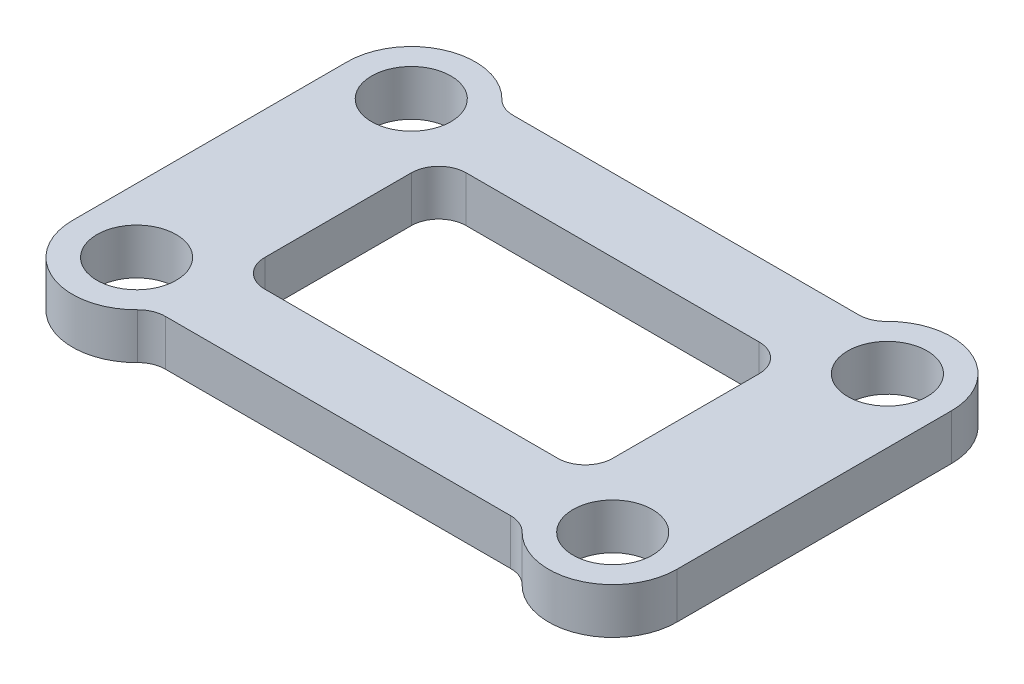
ISO-10303-21;
HEADER;
FILE_DESCRIPTION(('STEP AP214'),'2;1');
FILE_NAME('part.step','',(''),(''),'','','');
FILE_SCHEMA(('AUTOMOTIVE_DESIGN { 1 0 10303 214 1 1 1 1 }'));
ENDSEC;
DATA;
#1=APPLICATION_CONTEXT('core data for automotive mechanical design processes');
#2=APPLICATION_PROTOCOL_DEFINITION('international standard','automotive_design',2000,#1);
#3=PRODUCT_CONTEXT('',#1,'mechanical');
#4=PRODUCT('Part','Part','',(#3));
#5=PRODUCT_RELATED_PRODUCT_CATEGORY('part','',(#4));
#6=PRODUCT_DEFINITION_FORMATION('','',#4);
#7=PRODUCT_DEFINITION_CONTEXT('part definition',#1,'design');
#8=PRODUCT_DEFINITION('design','',#6,#7);
#9=PRODUCT_DEFINITION_SHAPE('','',#8);
#10=(LENGTH_UNIT() NAMED_UNIT(*) SI_UNIT(.MILLI.,.METRE.));
#11=(NAMED_UNIT(*) PLANE_ANGLE_UNIT() SI_UNIT($,.RADIAN.));
#12=(NAMED_UNIT(*) SI_UNIT($,.STERADIAN.) SOLID_ANGLE_UNIT());
#13=UNCERTAINTY_MEASURE_WITH_UNIT(LENGTH_MEASURE(1.E-05),#10,'distance_accuracy_value','');
#14=(GEOMETRIC_REPRESENTATION_CONTEXT(3) GLOBAL_UNCERTAINTY_ASSIGNED_CONTEXT((#13)) GLOBAL_UNIT_ASSIGNED_CONTEXT((#10,
#11,#12)) REPRESENTATION_CONTEXT('',''));
#15=CARTESIAN_POINT('',(0.,0.,0.));
#16=DIRECTION('',(0.,0.,1.));
#17=DIRECTION('',(1.,0.,0.));
#18=AXIS2_PLACEMENT_3D('',#15,#16,#17);
#19=CARTESIAN_POINT('',(-24.765,-22.225,9.525));
#20=DIRECTION('',(-1.,0.,0.));
#21=DIRECTION('',(0.,0.,1.));
#22=AXIS2_PLACEMENT_3D('',#19,#20,#21);
#23=PLANE('',#22);
#24=DIRECTION('',(0.,0.,1.));
#25=VECTOR('',#24,1.);
#26=CARTESIAN_POINT('',(-24.765,-22.225,9.525));
#27=LINE('',#26,#25);
#28=CARTESIAN_POINT('',(-24.765,-22.225,-5.08));
#29=VERTEX_POINT('',#28);
#30=CARTESIAN_POINT('',(-24.765,-22.225,5.08));
#31=VERTEX_POINT('',#30);
#32=EDGE_CURVE('E238',#29,#31,#27,.T.);
#33=ORIENTED_EDGE('',*,*,#32,.F.);
#34=DIRECTION('',(0.,-1.,0.));
#35=VECTOR('',#34,1.);
#36=CARTESIAN_POINT('',(-24.765,-19.05,-5.08));
#37=LINE('',#36,#35);
#38=CARTESIAN_POINT('',(-24.765,-19.05,-5.08));
#39=VERTEX_POINT('',#38);
#40=EDGE_CURVE('E273',#29,#39,#37,.F.);
#41=ORIENTED_EDGE('',*,*,#40,.T.);
#42=DIRECTION('',(0.,0.,1.));
#43=VECTOR('',#42,1.);
#44=CARTESIAN_POINT('',(-24.765,-19.05,9.525));
#45=LINE('',#44,#43);
#46=CARTESIAN_POINT('',(-24.765,-19.05,5.08));
#47=VERTEX_POINT('',#46);
#48=EDGE_CURVE('E233',#39,#47,#45,.T.);
#49=ORIENTED_EDGE('',*,*,#48,.T.);
#50=DIRECTION('',(0.,-1.,0.));
#51=VECTOR('',#50,1.);
#52=CARTESIAN_POINT('',(-24.765,-22.225,5.08));
#53=LINE('',#52,#51);
#54=EDGE_CURVE('E270',#47,#31,#53,.T.);
#55=ORIENTED_EDGE('',*,*,#54,.T.);
#56=EDGE_LOOP('',(#33,#41,#49,#55));
#57=FACE_BOUND('',#56,.T.);
#58=ADVANCED_FACE('F41',(#57),#23,.F.);
#59=CARTESIAN_POINT('',(-0.635,-22.225,9.525));
#60=DIRECTION('',(1.,0.,0.));
#61=DIRECTION('',(0.,0.,-1.));
#62=AXIS2_PLACEMENT_3D('',#59,#60,#61);
#63=PLANE('',#62);
#64=DIRECTION('',(0.,0.,-1.));
#65=VECTOR('',#64,1.);
#66=CARTESIAN_POINT('',(-0.635,-22.225,9.525));
#67=LINE('',#66,#65);
#68=CARTESIAN_POINT('',(-0.635,-22.225,5.08));
#69=VERTEX_POINT('',#68);
#70=CARTESIAN_POINT('',(-0.635,-22.225,-5.08));
#71=VERTEX_POINT('',#70);
#72=EDGE_CURVE('E217',#69,#71,#67,.T.);
#73=ORIENTED_EDGE('',*,*,#72,.F.);
#74=DIRECTION('',(0.,-1.,0.));
#75=VECTOR('',#74,1.);
#76=CARTESIAN_POINT('',(-0.635,-22.225,5.08));
#77=LINE('',#76,#75);
#78=CARTESIAN_POINT('',(-0.635,-19.05,5.08));
#79=VERTEX_POINT('',#78);
#80=EDGE_CURVE('E262',#69,#79,#77,.F.);
#81=ORIENTED_EDGE('',*,*,#80,.T.);
#82=DIRECTION('',(0.,0.,-1.));
#83=VECTOR('',#82,1.);
#84=CARTESIAN_POINT('',(-0.635,-19.05,9.525));
#85=LINE('',#84,#83);
#86=CARTESIAN_POINT('',(-0.635,-19.05,-5.08));
#87=VERTEX_POINT('',#86);
#88=EDGE_CURVE('E205',#79,#87,#85,.T.);
#89=ORIENTED_EDGE('',*,*,#88,.T.);
#90=DIRECTION('',(0.,1.,0.));
#91=VECTOR('',#90,1.);
#92=CARTESIAN_POINT('',(-0.635,-22.225,-5.08));
#93=LINE('',#92,#91);
#94=EDGE_CURVE('E260',#87,#71,#93,.F.);
#95=ORIENTED_EDGE('',*,*,#94,.T.);
#96=EDGE_LOOP('',(#73,#81,#89,#95));
#97=FACE_BOUND('',#96,.T.);
#98=ADVANCED_FACE('F338',(#97),#63,.F.);
#99=CARTESIAN_POINT('',(-29.21,14.3584839524334,12.065));
#100=DIRECTION('',(0.,0.,-1.));
#101=DIRECTION('',(-1.,0.,0.));
#102=AXIS2_PLACEMENT_3D('',#99,#100,#101);
#103=PLANE('',#102);
#104=DIRECTION('',(1.,0.,0.));
#105=VECTOR('',#104,1.);
#106=CARTESIAN_POINT('',(-29.21,-22.225,12.065));
#107=LINE('',#106,#105);
#108=CARTESIAN_POINT('',(-24.6751929478753,-22.225,12.065));
#109=VERTEX_POINT('',#108);
#110=CARTESIAN_POINT('',(-0.724807052124712,-22.225,12.065));
#111=VERTEX_POINT('',#110);
#112=EDGE_CURVE('E208',#109,#111,#107,.T.);
#113=ORIENTED_EDGE('',*,*,#112,.T.);
#114=DIRECTION('',(0.,-1.,0.));
#115=VECTOR('',#114,1.);
#116=CARTESIAN_POINT('',(-0.72480705212471,-19.05,12.065));
#117=LINE('',#116,#115);
#118=CARTESIAN_POINT('',(-0.724807052124712,-19.05,12.065));
#119=VERTEX_POINT('',#118);
#120=EDGE_CURVE('E290',#111,#119,#117,.F.);
#121=ORIENTED_EDGE('',*,*,#120,.T.);
#122=DIRECTION('',(-1.,0.,0.));
#123=VECTOR('',#122,1.);
#124=CARTESIAN_POINT('',(-29.21,-19.05,12.065));
#125=LINE('',#124,#123);
#126=CARTESIAN_POINT('',(-24.6751929478753,-19.05,12.065));
#127=VERTEX_POINT('',#126);
#128=EDGE_CURVE('E221',#119,#127,#125,.T.);
#129=ORIENTED_EDGE('',*,*,#128,.T.);
#130=DIRECTION('',(0.,-1.,0.));
#131=VECTOR('',#130,1.);
#132=CARTESIAN_POINT('',(-24.6751929478753,-22.225,12.065));
#133=LINE('',#132,#131);
#134=EDGE_CURVE('E287',#127,#109,#133,.T.);
#135=ORIENTED_EDGE('',*,*,#134,.T.);
#136=EDGE_LOOP('',(#113,#121,#129,#135));
#137=FACE_BOUND('',#136,.T.);
#138=ADVANCED_FACE('F324',(#137),#103,.F.);
#139=CARTESIAN_POINT('',(-29.21,14.3584839524334,6.985));
#140=DIRECTION('',(0.,0.,-1.));
#141=DIRECTION('',(-1.,0.,0.));
#142=AXIS2_PLACEMENT_3D('',#139,#140,#141);
#143=PLANE('',#142);
#144=DIRECTION('',(-1.,0.,0.));
#145=VECTOR('',#144,1.);
#146=CARTESIAN_POINT('',(-29.21,-19.05,6.985));
#147=LINE('',#146,#145);
#148=CARTESIAN_POINT('',(-2.54,-19.05,6.985));
#149=VERTEX_POINT('',#148);
#150=CARTESIAN_POINT('',(-22.86,-19.05,6.985));
#151=VERTEX_POINT('',#150);
#152=EDGE_CURVE('E224',#149,#151,#147,.T.);
#153=ORIENTED_EDGE('',*,*,#152,.F.);
#154=DIRECTION('',(0.,-1.,0.));
#155=VECTOR('',#154,1.);
#156=CARTESIAN_POINT('',(-2.54,14.3584839524334,6.985));
#157=LINE('',#156,#155);
#158=CARTESIAN_POINT('',(-2.54,-22.225,6.985));
#159=VERTEX_POINT('',#158);
#160=EDGE_CURVE('E257',#149,#159,#157,.T.);
#161=ORIENTED_EDGE('',*,*,#160,.T.);
#162=DIRECTION('',(1.,0.,0.));
#163=VECTOR('',#162,1.);
#164=CARTESIAN_POINT('',(-29.21,-22.225,6.985));
#165=LINE('',#164,#163);
#166=CARTESIAN_POINT('',(-22.86,-22.225,6.985));
#167=VERTEX_POINT('',#166);
#168=EDGE_CURVE('E204',#167,#159,#165,.T.);
#169=ORIENTED_EDGE('',*,*,#168,.F.);
#170=DIRECTION('',(0.,-1.,0.));
#171=VECTOR('',#170,1.);
#172=CARTESIAN_POINT('',(-22.86,14.3584839524334,6.985));
#173=LINE('',#172,#171);
#174=EDGE_CURVE('E255',#167,#151,#173,.F.);
#175=ORIENTED_EDGE('',*,*,#174,.T.);
#176=EDGE_LOOP('',(#153,#161,#169,#175));
#177=FACE_BOUND('',#176,.T.);
#178=ADVANCED_FACE('F362',(#177),#143,.T.);
#179=CARTESIAN_POINT('',(-29.21,-22.225,9.525));
#180=DIRECTION('',(0.,1.,0.));
#181=DIRECTION('',(0.,0.,1.));
#182=AXIS2_PLACEMENT_3D('',#179,#180,#181);
#183=CYLINDRICAL_SURFACE('',#182,4.445);
#184=CARTESIAN_POINT('',(-29.21,-22.225,9.525));
#185=DIRECTION('',(0.,-1.,0.));
#186=DIRECTION('',(0.,0.,-1.));
#187=AXIS2_PLACEMENT_3D('',#184,#185,#186);
#188=CIRCLE('',#187,4.445);
#189=CARTESIAN_POINT('',(-26.0356350635127,-22.225,12.6365));
#190=VERTEX_POINT('',#189);
#191=CARTESIAN_POINT('',(-33.655,-22.225,9.525));
#192=VERTEX_POINT('',#191);
#193=EDGE_CURVE('E230',#190,#192,#188,.T.);
#194=ORIENTED_EDGE('',*,*,#193,.F.);
#195=DIRECTION('',(0.,1.,0.));
#196=VECTOR('',#195,1.);
#197=CARTESIAN_POINT('',(-26.0356350635127,-22.225,12.6365));
#198=LINE('',#197,#196);
#199=CARTESIAN_POINT('',(-26.0356350635127,-19.05,12.6365));
#200=VERTEX_POINT('',#199);
#201=EDGE_CURVE('E62',#190,#200,#198,.T.);
#202=ORIENTED_EDGE('',*,*,#201,.T.);
#203=CARTESIAN_POINT('',(-29.21,-19.05,9.525));
#204=DIRECTION('',(0.,-1.,0.));
#205=DIRECTION('',(0.,0.,-1.));
#206=AXIS2_PLACEMENT_3D('',#203,#204,#205);
#207=CIRCLE('',#206,4.445);
#208=CARTESIAN_POINT('',(-33.655,-19.05,9.525));
#209=VERTEX_POINT('',#208);
#210=EDGE_CURVE('E226',#200,#209,#207,.T.);
#211=ORIENTED_EDGE('',*,*,#210,.T.);
#212=DIRECTION('',(0.,1.,0.));
#213=VECTOR('',#212,1.);
#214=CARTESIAN_POINT('',(-33.655,-22.225,9.525));
#215=LINE('',#214,#213);
#216=EDGE_CURVE('E252',#192,#209,#215,.T.);
#217=ORIENTED_EDGE('',*,*,#216,.F.);
#218=EDGE_LOOP('',(#194,#202,#211,#217));
#219=FACE_BOUND('',#218,.T.);
#220=ADVANCED_FACE('F358',(#219),#183,.T.);
#221=CARTESIAN_POINT('',(-33.655,-22.225,9.525));
#222=DIRECTION('',(1.,0.,0.));
#223=DIRECTION('',(0.,0.,-1.));
#224=AXIS2_PLACEMENT_3D('',#221,#222,#223);
#225=PLANE('',#224);
#226=DIRECTION('',(0.,0.,-1.));
#227=VECTOR('',#226,1.);
#228=CARTESIAN_POINT('',(-33.655,-19.05,9.525));
#229=LINE('',#228,#227);
#230=CARTESIAN_POINT('',(-33.655,-19.05,-9.525));
#231=VERTEX_POINT('',#230);
#232=EDGE_CURVE('E243',#209,#231,#229,.T.);
#233=ORIENTED_EDGE('',*,*,#232,.T.);
#234=DIRECTION('',(0.,1.,0.));
#235=VECTOR('',#234,1.);
#236=CARTESIAN_POINT('',(-33.655,-22.225,-9.525));
#237=LINE('',#236,#235);
#238=CARTESIAN_POINT('',(-33.655,-22.225,-9.525));
#239=VERTEX_POINT('',#238);
#240=EDGE_CURVE('E241',#239,#231,#237,.T.);
#241=ORIENTED_EDGE('',*,*,#240,.F.);
#242=DIRECTION('',(0.,0.,-1.));
#243=VECTOR('',#242,1.);
#244=CARTESIAN_POINT('',(-33.655,-22.225,9.525));
#245=LINE('',#244,#243);
#246=EDGE_CURVE('E232',#192,#239,#245,.T.);
#247=ORIENTED_EDGE('',*,*,#246,.F.);
#248=ORIENTED_EDGE('',*,*,#216,.T.);
#249=EDGE_LOOP('',(#233,#241,#247,#248));
#250=FACE_BOUND('',#249,.T.);
#251=ADVANCED_FACE('F354',(#250),#225,.F.);
#252=CARTESIAN_POINT('',(-29.21,-22.225,-9.525));
#253=DIRECTION('',(0.,1.,0.));
#254=DIRECTION('',(0.,0.,1.));
#255=AXIS2_PLACEMENT_3D('',#252,#253,#254);
#256=CYLINDRICAL_SURFACE('',#255,4.445);
#257=CARTESIAN_POINT('',(-29.21,-19.05,-9.525));
#258=DIRECTION('',(0.,-1.,0.));
#259=DIRECTION('',(0.,0.,-1.));
#260=AXIS2_PLACEMENT_3D('',#257,#258,#259);
#261=CIRCLE('',#260,4.445);
#262=CARTESIAN_POINT('',(-26.0356350635127,-19.05,-12.6365));
#263=VERTEX_POINT('',#262);
#264=EDGE_CURVE('E245',#231,#263,#261,.T.);
#265=ORIENTED_EDGE('',*,*,#264,.T.);
#266=DIRECTION('',(0.,1.,0.));
#267=VECTOR('',#266,1.);
#268=CARTESIAN_POINT('',(-26.0356350635127,-22.225,-12.6365));
#269=LINE('',#268,#267);
#270=CARTESIAN_POINT('',(-26.0356350635127,-22.225,-12.6365));
#271=VERTEX_POINT('',#270);
#272=EDGE_CURVE('E275',#263,#271,#269,.F.);
#273=ORIENTED_EDGE('',*,*,#272,.T.);
#274=CARTESIAN_POINT('',(-29.21,-22.225,-9.525));
#275=DIRECTION('',(0.,-1.,0.));
#276=DIRECTION('',(0.,0.,-1.));
#277=AXIS2_PLACEMENT_3D('',#274,#275,#276);
#278=CIRCLE('',#277,4.445);
#279=EDGE_CURVE('E235',#239,#271,#278,.T.);
#280=ORIENTED_EDGE('',*,*,#279,.F.);
#281=ORIENTED_EDGE('',*,*,#240,.T.);
#282=EDGE_LOOP('',(#265,#273,#280,#281));
#283=FACE_BOUND('',#282,.T.);
#284=ADVANCED_FACE('F351',(#283),#256,.T.);
#285=CARTESIAN_POINT('',(-29.21,-22.225,9.525));
#286=DIRECTION('',(0.,-1.,0.));
#287=DIRECTION('',(0.,0.,-1.));
#288=AXIS2_PLACEMENT_3D('',#285,#286,#287);
#289=PLANE('',#288);
#290=CARTESIAN_POINT('',(-29.21,-22.225,9.525));
#291=DIRECTION('',(0.,-1.,0.));
#292=DIRECTION('',(0.,0.,-1.));
#293=AXIS2_PLACEMENT_3D('',#290,#291,#292);
#294=CIRCLE('',#293,2.74999999999999);
#295=CARTESIAN_POINT('',(-29.21,-22.225,6.77500000000001));
#296=VERTEX_POINT('',#295);
#297=EDGE_CURVE('E448',#296,#296,#294,.T.);
#298=ORIENTED_EDGE('',*,*,#297,.F.);
#299=EDGE_LOOP('',(#298));
#300=FACE_BOUND('',#299,.T.);
#301=CARTESIAN_POINT('',(-29.21,-22.225,-9.525));
#302=DIRECTION('',(0.,-1.,0.));
#303=DIRECTION('',(0.,0.,-1.));
#304=AXIS2_PLACEMENT_3D('',#301,#302,#303);
#305=CIRCLE('',#304,2.74999999999999);
#306=CARTESIAN_POINT('',(-29.21,-22.225,-12.275));
#307=VERTEX_POINT('',#306);
#308=EDGE_CURVE('E442',#307,#307,#305,.T.);
#309=ORIENTED_EDGE('',*,*,#308,.F.);
#310=EDGE_LOOP('',(#309));
#311=FACE_BOUND('',#310,.T.);
#312=CARTESIAN_POINT('',(3.81,-22.225,9.525));
#313=DIRECTION('',(0.,-1.,0.));
#314=DIRECTION('',(0.,0.,-1.));
#315=AXIS2_PLACEMENT_3D('',#312,#313,#314);
#316=CIRCLE('',#315,2.74999999999999);
#317=CARTESIAN_POINT('',(3.81,-22.225,6.77500000000001));
#318=VERTEX_POINT('',#317);
#319=EDGE_CURVE('E436',#318,#318,#316,.T.);
#320=ORIENTED_EDGE('',*,*,#319,.F.);
#321=EDGE_LOOP('',(#320));
#322=FACE_BOUND('',#321,.T.);
#323=CARTESIAN_POINT('',(3.81,-22.225,-9.525));
#324=DIRECTION('',(0.,-1.,0.));
#325=DIRECTION('',(0.,0.,-1.));
#326=AXIS2_PLACEMENT_3D('',#323,#324,#325);
#327=CIRCLE('',#326,2.74999999999999);
#328=CARTESIAN_POINT('',(3.81,-22.225,-12.275));
#329=VERTEX_POINT('',#328);
#330=EDGE_CURVE('E430',#329,#329,#327,.T.);
#331=ORIENTED_EDGE('',*,*,#330,.F.);
#332=EDGE_LOOP('',(#331));
#333=FACE_BOUND('',#332,.T.);
#334=ORIENTED_EDGE('',*,*,#279,.T.);
#335=CARTESIAN_POINT('',(-24.6751929478753,-22.225,-13.97));
#336=DIRECTION('',(0.,-1.,0.));
#337=DIRECTION('',(0.,0.,-1.));
#338=AXIS2_PLACEMENT_3D('',#335,#336,#337);
#339=CIRCLE('',#338,1.905);
#340=CARTESIAN_POINT('',(-24.6751929478753,-22.225,-12.065));
#341=VERTEX_POINT('',#340);
#342=EDGE_CURVE('E301',#271,#341,#339,.F.);
#343=ORIENTED_EDGE('',*,*,#342,.T.);
#344=DIRECTION('',(1.,0.,0.));
#345=VECTOR('',#344,1.);
#346=CARTESIAN_POINT('',(-29.21,-22.225,-12.065));
#347=LINE('',#346,#345);
#348=CARTESIAN_POINT('',(-0.724807052124708,-22.225,-12.065));
#349=VERTEX_POINT('',#348);
#350=EDGE_CURVE('E397',#341,#349,#347,.T.);
#351=ORIENTED_EDGE('',*,*,#350,.T.);
#352=CARTESIAN_POINT('',(-0.724807052124709,-22.225,-13.97));
#353=DIRECTION('',(0.,-1.,0.));
#354=DIRECTION('',(0.,0.,-1.));
#355=AXIS2_PLACEMENT_3D('',#352,#353,#354);
#356=CIRCLE('',#355,1.905);
#357=CARTESIAN_POINT('',(0.635635063512704,-22.225,-12.6365));
#358=VERTEX_POINT('',#357);
#359=EDGE_CURVE('E307',#349,#358,#356,.F.);
#360=ORIENTED_EDGE('',*,*,#359,.T.);
#361=CARTESIAN_POINT('',(3.81,-22.225,-9.525));
#362=DIRECTION('',(0.,-1.,0.));
#363=DIRECTION('',(0.,0.,-1.));
#364=AXIS2_PLACEMENT_3D('',#361,#362,#363);
#365=CIRCLE('',#364,4.445);
#366=CARTESIAN_POINT('',(8.255,-22.225,-9.525));
#367=VERTEX_POINT('',#366);
#368=EDGE_CURVE('E215',#358,#367,#365,.T.);
#369=ORIENTED_EDGE('',*,*,#368,.T.);
#370=DIRECTION('',(0.,0.,1.));
#371=VECTOR('',#370,1.);
#372=CARTESIAN_POINT('',(8.255,-22.225,9.525));
#373=LINE('',#372,#371);
#374=CARTESIAN_POINT('',(8.255,-22.225,9.525));
#375=VERTEX_POINT('',#374);
#376=EDGE_CURVE('E198',#367,#375,#373,.T.);
#377=ORIENTED_EDGE('',*,*,#376,.T.);
#378=CARTESIAN_POINT('',(3.81,-22.225,9.525));
#379=DIRECTION('',(0.,-1.,0.));
#380=DIRECTION('',(0.,0.,-1.));
#381=AXIS2_PLACEMENT_3D('',#378,#379,#380);
#382=CIRCLE('',#381,4.445);
#383=CARTESIAN_POINT('',(0.635635063512703,-22.225,12.6365));
#384=VERTEX_POINT('',#383);
#385=EDGE_CURVE('E189',#375,#384,#382,.T.);
#386=ORIENTED_EDGE('',*,*,#385,.T.);
#387=CARTESIAN_POINT('',(-0.72480705212471,-22.225,13.97));
#388=DIRECTION('',(0.,-1.,0.));
#389=DIRECTION('',(0.,0.,-1.));
#390=AXIS2_PLACEMENT_3D('',#387,#388,#389);
#391=CIRCLE('',#390,1.905);
#392=EDGE_CURVE('E317',#384,#111,#391,.F.);
#393=ORIENTED_EDGE('',*,*,#392,.T.);
#394=ORIENTED_EDGE('',*,*,#112,.F.);
#395=CARTESIAN_POINT('',(-24.6751929478753,-22.225,13.97));
#396=DIRECTION('',(0.,-1.,0.));
#397=DIRECTION('',(0.,0.,-1.));
#398=AXIS2_PLACEMENT_3D('',#395,#396,#397);
#399=CIRCLE('',#398,1.905);
#400=EDGE_CURVE('E49',#109,#190,#399,.F.);
#401=ORIENTED_EDGE('',*,*,#400,.T.);
#402=ORIENTED_EDGE('',*,*,#193,.T.);
#403=ORIENTED_EDGE('',*,*,#246,.T.);
#404=EDGE_LOOP('',(#334,#343,#351,#360,#369,#377,#386,#393,#394,#401,#402,#403));
#405=FACE_BOUND('',#404,.T.);
#406=DIRECTION('',(1.,0.,0.));
#407=VECTOR('',#406,1.);
#408=CARTESIAN_POINT('',(-29.21,-22.225,-6.985));
#409=LINE('',#408,#407);
#410=CARTESIAN_POINT('',(-22.86,-22.225,-6.985));
#411=VERTEX_POINT('',#410);
#412=CARTESIAN_POINT('',(-2.54,-22.225,-6.985));
#413=VERTEX_POINT('',#412);
#414=EDGE_CURVE('E389',#411,#413,#409,.T.);
#415=ORIENTED_EDGE('',*,*,#414,.F.);
#416=CARTESIAN_POINT('',(-22.86,-22.225,-5.08));
#417=DIRECTION('',(0.,-1.,0.));
#418=DIRECTION('',(0.,0.,-1.));
#419=AXIS2_PLACEMENT_3D('',#416,#417,#418);
#420=CIRCLE('',#419,1.905);
#421=EDGE_CURVE('E297',#411,#29,#420,.F.);
#422=ORIENTED_EDGE('',*,*,#421,.T.);
#423=ORIENTED_EDGE('',*,*,#32,.T.);
#424=CARTESIAN_POINT('',(-22.86,-22.225,5.08));
#425=DIRECTION('',(0.,-1.,0.));
#426=DIRECTION('',(0.,0.,-1.));
#427=AXIS2_PLACEMENT_3D('',#424,#425,#426);
#428=CIRCLE('',#427,1.905);
#429=EDGE_CURVE('E313',#31,#167,#428,.F.);
#430=ORIENTED_EDGE('',*,*,#429,.T.);
#431=ORIENTED_EDGE('',*,*,#168,.T.);
#432=CARTESIAN_POINT('',(-2.54,-22.225,5.08));
#433=DIRECTION('',(0.,-1.,0.));
#434=DIRECTION('',(0.,0.,-1.));
#435=AXIS2_PLACEMENT_3D('',#432,#433,#434);
#436=CIRCLE('',#435,1.905);
#437=EDGE_CURVE('E293',#159,#69,#436,.F.);
#438=ORIENTED_EDGE('',*,*,#437,.T.);
#439=ORIENTED_EDGE('',*,*,#72,.T.);
#440=CARTESIAN_POINT('',(-2.54,-22.225,-5.08));
#441=DIRECTION('',(0.,-1.,0.));
#442=DIRECTION('',(0.,0.,-1.));
#443=AXIS2_PLACEMENT_3D('',#440,#441,#442);
#444=CIRCLE('',#443,1.905);
#445=EDGE_CURVE('E311',#71,#413,#444,.F.);
#446=ORIENTED_EDGE('',*,*,#445,.T.);
#447=EDGE_LOOP('',(#415,#422,#423,#430,#431,#438,#439,#446));
#448=FACE_BOUND('',#447,.T.);
#449=ADVANCED_FACE('F319',(#300,#311,#322,#333,#405,#448),#289,.T.);
#450=CARTESIAN_POINT('',(-29.21,-19.05,9.525));
#451=DIRECTION('',(0.,-1.,0.));
#452=DIRECTION('',(0.,0.,-1.));
#453=AXIS2_PLACEMENT_3D('',#450,#451,#452);
#454=PLANE('',#453);
#455=CARTESIAN_POINT('',(-29.21,-19.05,9.525));
#456=DIRECTION('',(0.,-1.,0.));
#457=DIRECTION('',(0.,0.,-1.));
#458=AXIS2_PLACEMENT_3D('',#455,#456,#457);
#459=CIRCLE('',#458,2.75);
#460=CARTESIAN_POINT('',(-29.21,-19.05,6.775));
#461=VERTEX_POINT('',#460);
#462=EDGE_CURVE('E445',#461,#461,#459,.T.);
#463=ORIENTED_EDGE('',*,*,#462,.T.);
#464=EDGE_LOOP('',(#463));
#465=FACE_BOUND('',#464,.T.);
#466=CARTESIAN_POINT('',(-29.21,-19.05,-9.525));
#467=DIRECTION('',(0.,-1.,0.));
#468=DIRECTION('',(0.,0.,-1.));
#469=AXIS2_PLACEMENT_3D('',#466,#467,#468);
#470=CIRCLE('',#469,2.75);
#471=CARTESIAN_POINT('',(-29.21,-19.05,-12.275));
#472=VERTEX_POINT('',#471);
#473=EDGE_CURVE('E439',#472,#472,#470,.T.);
#474=ORIENTED_EDGE('',*,*,#473,.T.);
#475=EDGE_LOOP('',(#474));
#476=FACE_BOUND('',#475,.T.);
#477=CARTESIAN_POINT('',(3.81,-19.05,9.525));
#478=DIRECTION('',(0.,-1.,0.));
#479=DIRECTION('',(0.,0.,-1.));
#480=AXIS2_PLACEMENT_3D('',#477,#478,#479);
#481=CIRCLE('',#480,2.75);
#482=CARTESIAN_POINT('',(3.81,-19.05,6.775));
#483=VERTEX_POINT('',#482);
#484=EDGE_CURVE('E433',#483,#483,#481,.T.);
#485=ORIENTED_EDGE('',*,*,#484,.T.);
#486=EDGE_LOOP('',(#485));
#487=FACE_BOUND('',#486,.T.);
#488=CARTESIAN_POINT('',(3.81,-19.05,-9.525));
#489=DIRECTION('',(0.,-1.,0.));
#490=DIRECTION('',(0.,0.,-1.));
#491=AXIS2_PLACEMENT_3D('',#488,#489,#490);
#492=CIRCLE('',#491,2.75);
#493=CARTESIAN_POINT('',(3.81,-19.05,-12.275));
#494=VERTEX_POINT('',#493);
#495=EDGE_CURVE('E402',#494,#494,#492,.T.);
#496=ORIENTED_EDGE('',*,*,#495,.T.);
#497=EDGE_LOOP('',(#496));
#498=FACE_BOUND('',#497,.T.);
#499=ORIENTED_EDGE('',*,*,#48,.F.);
#500=CARTESIAN_POINT('',(-22.86,-19.05,-5.08));
#501=DIRECTION('',(0.,-1.,0.));
#502=DIRECTION('',(0.,0.,-1.));
#503=AXIS2_PLACEMENT_3D('',#500,#501,#502);
#504=CIRCLE('',#503,1.905);
#505=CARTESIAN_POINT('',(-22.86,-19.05,-6.985));
#506=VERTEX_POINT('',#505);
#507=EDGE_CURVE('E299',#39,#506,#504,.T.);
#508=ORIENTED_EDGE('',*,*,#507,.T.);
#509=DIRECTION('',(-1.,0.,0.));
#510=VECTOR('',#509,1.);
#511=CARTESIAN_POINT('',(-29.21,-19.05,-6.985));
#512=LINE('',#511,#510);
#513=CARTESIAN_POINT('',(-2.54,-19.05,-6.985));
#514=VERTEX_POINT('',#513);
#515=EDGE_CURVE('E396',#514,#506,#512,.T.);
#516=ORIENTED_EDGE('',*,*,#515,.F.);
#517=CARTESIAN_POINT('',(-2.54,-19.05,-5.08));
#518=DIRECTION('',(0.,-1.,0.));
#519=DIRECTION('',(0.,0.,-1.));
#520=AXIS2_PLACEMENT_3D('',#517,#518,#519);
#521=CIRCLE('',#520,1.905);
#522=EDGE_CURVE('E309',#514,#87,#521,.T.);
#523=ORIENTED_EDGE('',*,*,#522,.T.);
#524=ORIENTED_EDGE('',*,*,#88,.F.);
#525=CARTESIAN_POINT('',(-2.54,-19.05,5.08));
#526=DIRECTION('',(0.,-1.,0.));
#527=DIRECTION('',(0.,0.,-1.));
#528=AXIS2_PLACEMENT_3D('',#525,#526,#527);
#529=CIRCLE('',#528,1.905);
#530=EDGE_CURVE('E295',#79,#149,#529,.T.);
#531=ORIENTED_EDGE('',*,*,#530,.T.);
#532=ORIENTED_EDGE('',*,*,#152,.T.);
#533=CARTESIAN_POINT('',(-22.86,-19.05,5.08));
#534=DIRECTION('',(0.,-1.,0.));
#535=DIRECTION('',(0.,0.,-1.));
#536=AXIS2_PLACEMENT_3D('',#533,#534,#535);
#537=CIRCLE('',#536,1.905);
#538=EDGE_CURVE('E315',#151,#47,#537,.T.);
#539=ORIENTED_EDGE('',*,*,#538,.T.);
#540=EDGE_LOOP('',(#499,#508,#516,#523,#524,#531,#532,#539));
#541=FACE_BOUND('',#540,.T.);
#542=CARTESIAN_POINT('',(3.81,-19.05,-9.525));
#543=DIRECTION('',(0.,-1.,0.));
#544=DIRECTION('',(0.,0.,-1.));
#545=AXIS2_PLACEMENT_3D('',#542,#543,#544);
#546=CIRCLE('',#545,4.445);
#547=CARTESIAN_POINT('',(0.635635063512704,-19.05,-12.6365));
#548=VERTEX_POINT('',#547);
#549=CARTESIAN_POINT('',(8.255,-19.05,-9.525));
#550=VERTEX_POINT('',#549);
#551=EDGE_CURVE('E188',#548,#550,#546,.T.);
#552=ORIENTED_EDGE('',*,*,#551,.F.);
#553=CARTESIAN_POINT('',(-0.724807052124709,-19.05,-13.97));
#554=DIRECTION('',(0.,-1.,0.));
#555=DIRECTION('',(0.,0.,-1.));
#556=AXIS2_PLACEMENT_3D('',#553,#554,#555);
#557=CIRCLE('',#556,1.905);
#558=CARTESIAN_POINT('',(-0.724807052124708,-19.05,-12.065));
#559=VERTEX_POINT('',#558);
#560=EDGE_CURVE('E305',#548,#559,#557,.T.);
#561=ORIENTED_EDGE('',*,*,#560,.T.);
#562=DIRECTION('',(-1.,0.,0.));
#563=VECTOR('',#562,1.);
#564=CARTESIAN_POINT('',(-29.21,-19.05,-12.065));
#565=LINE('',#564,#563);
#566=CARTESIAN_POINT('',(-24.6751929478753,-19.05,-12.065));
#567=VERTEX_POINT('',#566);
#568=EDGE_CURVE('E399',#559,#567,#565,.T.);
#569=ORIENTED_EDGE('',*,*,#568,.T.);
#570=CARTESIAN_POINT('',(-24.6751929478753,-19.05,-13.97));
#571=DIRECTION('',(0.,-1.,0.));
#572=DIRECTION('',(0.,0.,-1.));
#573=AXIS2_PLACEMENT_3D('',#570,#571,#572);
#574=CIRCLE('',#573,1.905);
#575=EDGE_CURVE('E303',#567,#263,#574,.T.);
#576=ORIENTED_EDGE('',*,*,#575,.T.);
#577=ORIENTED_EDGE('',*,*,#264,.F.);
#578=ORIENTED_EDGE('',*,*,#232,.F.);
#579=ORIENTED_EDGE('',*,*,#210,.F.);
#580=CARTESIAN_POINT('',(-24.6751929478753,-19.05,13.97));
#581=DIRECTION('',(0.,-1.,0.));
#582=DIRECTION('',(0.,0.,-1.));
#583=AXIS2_PLACEMENT_3D('',#580,#581,#582);
#584=CIRCLE('',#583,1.905);
#585=EDGE_CURVE('E11',#200,#127,#584,.T.);
#586=ORIENTED_EDGE('',*,*,#585,.T.);
#587=ORIENTED_EDGE('',*,*,#128,.F.);
#588=CARTESIAN_POINT('',(-0.72480705212471,-19.05,13.97));
#589=DIRECTION('',(0.,-1.,0.));
#590=DIRECTION('',(0.,0.,-1.));
#591=AXIS2_PLACEMENT_3D('',#588,#589,#590);
#592=CIRCLE('',#591,1.905);
#593=CARTESIAN_POINT('',(0.635635063512703,-19.05,12.6365));
#594=VERTEX_POINT('',#593);
#595=EDGE_CURVE('E203',#119,#594,#592,.T.);
#596=ORIENTED_EDGE('',*,*,#595,.T.);
#597=CARTESIAN_POINT('',(3.81,-19.05,9.525));
#598=DIRECTION('',(0.,-1.,0.));
#599=DIRECTION('',(0.,0.,-1.));
#600=AXIS2_PLACEMENT_3D('',#597,#598,#599);
#601=CIRCLE('',#600,4.445);
#602=CARTESIAN_POINT('',(8.255,-19.05,9.525));
#603=VERTEX_POINT('',#602);
#604=EDGE_CURVE('E195',#603,#594,#601,.T.);
#605=ORIENTED_EDGE('',*,*,#604,.F.);
#606=DIRECTION('',(0.,0.,1.));
#607=VECTOR('',#606,1.);
#608=CARTESIAN_POINT('',(8.255,-19.05,9.525));
#609=LINE('',#608,#607);
#610=EDGE_CURVE('E177',#550,#603,#609,.T.);
#611=ORIENTED_EDGE('',*,*,#610,.F.);
#612=EDGE_LOOP('',(#552,#561,#569,#576,#577,#578,#579,#586,#587,#596,#605,#611));
#613=FACE_BOUND('',#612,.T.);
#614=ADVANCED_FACE('F200',(#465,#476,#487,#498,#541,#613),#454,.F.);
#615=CARTESIAN_POINT('',(3.81,-22.225,9.525));
#616=DIRECTION('',(0.,1.,0.));
#617=DIRECTION('',(0.,0.,1.));
#618=AXIS2_PLACEMENT_3D('',#615,#616,#617);
#619=CYLINDRICAL_SURFACE('',#618,4.445);
#620=ORIENTED_EDGE('',*,*,#604,.T.);
#621=DIRECTION('',(0.,1.,0.));
#622=VECTOR('',#621,1.);
#623=CARTESIAN_POINT('',(0.635635063512703,-22.225,12.6365));
#624=LINE('',#623,#622);
#625=EDGE_CURVE('E285',#594,#384,#624,.F.);
#626=ORIENTED_EDGE('',*,*,#625,.T.);
#627=ORIENTED_EDGE('',*,*,#385,.F.);
#628=DIRECTION('',(0.,1.,0.));
#629=VECTOR('',#628,1.);
#630=CARTESIAN_POINT('',(8.255,-22.225,9.525));
#631=LINE('',#630,#629);
#632=EDGE_CURVE('E181',#375,#603,#631,.T.);
#633=ORIENTED_EDGE('',*,*,#632,.T.);
#634=EDGE_LOOP('',(#620,#626,#627,#633));
#635=FACE_BOUND('',#634,.T.);
#636=ADVANCED_FACE('F193',(#635),#619,.T.);
#637=CARTESIAN_POINT('',(3.81,-22.225,-9.525));
#638=DIRECTION('',(0.,1.,0.));
#639=DIRECTION('',(0.,0.,1.));
#640=AXIS2_PLACEMENT_3D('',#637,#638,#639);
#641=CYLINDRICAL_SURFACE('',#640,4.445);
#642=ORIENTED_EDGE('',*,*,#368,.F.);
#643=DIRECTION('',(0.,1.,0.));
#644=VECTOR('',#643,1.);
#645=CARTESIAN_POINT('',(0.635635063512704,-22.225,-12.6365));
#646=LINE('',#645,#644);
#647=EDGE_CURVE('E282',#358,#548,#646,.T.);
#648=ORIENTED_EDGE('',*,*,#647,.T.);
#649=ORIENTED_EDGE('',*,*,#551,.T.);
#650=DIRECTION('',(0.,1.,0.));
#651=VECTOR('',#650,1.);
#652=CARTESIAN_POINT('',(8.255,-22.225,-9.525));
#653=LINE('',#652,#651);
#654=EDGE_CURVE('E184',#367,#550,#653,.T.);
#655=ORIENTED_EDGE('',*,*,#654,.F.);
#656=EDGE_LOOP('',(#642,#648,#649,#655));
#657=FACE_BOUND('',#656,.T.);
#658=ADVANCED_FACE('F408',(#657),#641,.T.);
#659=CARTESIAN_POINT('',(8.255,-22.225,9.525));
#660=DIRECTION('',(-1.,0.,0.));
#661=DIRECTION('',(0.,0.,1.));
#662=AXIS2_PLACEMENT_3D('',#659,#660,#661);
#663=PLANE('',#662);
#664=ORIENTED_EDGE('',*,*,#610,.T.);
#665=ORIENTED_EDGE('',*,*,#632,.F.);
#666=ORIENTED_EDGE('',*,*,#376,.F.);
#667=ORIENTED_EDGE('',*,*,#654,.T.);
#668=EDGE_LOOP('',(#664,#665,#666,#667));
#669=FACE_BOUND('',#668,.T.);
#670=ADVANCED_FACE('F179',(#669),#663,.F.);
#671=CARTESIAN_POINT('',(-29.21,14.3584839524334,-6.985));
#672=DIRECTION('',(0.,0.,-1.));
#673=DIRECTION('',(-1.,0.,0.));
#674=AXIS2_PLACEMENT_3D('',#671,#672,#673);
#675=PLANE('',#674);
#676=ORIENTED_EDGE('',*,*,#515,.T.);
#677=DIRECTION('',(0.,-1.,0.));
#678=VECTOR('',#677,1.);
#679=CARTESIAN_POINT('',(-22.86,-22.225,-6.985));
#680=LINE('',#679,#678);
#681=EDGE_CURVE('E267',#506,#411,#680,.T.);
#682=ORIENTED_EDGE('',*,*,#681,.T.);
#683=ORIENTED_EDGE('',*,*,#414,.T.);
#684=DIRECTION('',(0.,1.,0.));
#685=VECTOR('',#684,1.);
#686=CARTESIAN_POINT('',(-2.54,-19.05,-6.985));
#687=LINE('',#686,#685);
#688=EDGE_CURVE('E264',#413,#514,#687,.T.);
#689=ORIENTED_EDGE('',*,*,#688,.T.);
#690=EDGE_LOOP('',(#676,#682,#683,#689));
#691=FACE_BOUND('',#690,.T.);
#692=ADVANCED_FACE('F393',(#691),#675,.F.);
#693=CARTESIAN_POINT('',(-29.21,14.3584839524334,-12.065));
#694=DIRECTION('',(0.,0.,-1.));
#695=DIRECTION('',(-1.,0.,0.));
#696=AXIS2_PLACEMENT_3D('',#693,#694,#695);
#697=PLANE('',#696);
#698=ORIENTED_EDGE('',*,*,#350,.F.);
#699=DIRECTION('',(0.,1.,0.));
#700=VECTOR('',#699,1.);
#701=CARTESIAN_POINT('',(-24.6751929478753,14.3584839524334,-12.065));
#702=LINE('',#701,#700);
#703=EDGE_CURVE('E280',#341,#567,#702,.T.);
#704=ORIENTED_EDGE('',*,*,#703,.T.);
#705=ORIENTED_EDGE('',*,*,#568,.F.);
#706=DIRECTION('',(0.,1.,0.));
#707=VECTOR('',#706,1.);
#708=CARTESIAN_POINT('',(-0.724807052124708,14.3584839524334,-12.065));
#709=LINE('',#708,#707);
#710=EDGE_CURVE('E278',#559,#349,#709,.F.);
#711=ORIENTED_EDGE('',*,*,#710,.T.);
#712=EDGE_LOOP('',(#698,#704,#705,#711));
#713=FACE_BOUND('',#712,.T.);
#714=ADVANCED_FACE('F416',(#713),#697,.T.);
#715=CARTESIAN_POINT('',(3.81,-22.225,-9.525));
#716=DIRECTION('',(0.,-1.,0.));
#717=DIRECTION('',(0.,0.,-1.));
#718=AXIS2_PLACEMENT_3D('',#715,#716,#717);
#719=CYLINDRICAL_SURFACE('',#718,2.74999999999999);
#720=ORIENTED_EDGE('',*,*,#495,.F.);
#721=EDGE_LOOP('',(#720));
#722=FACE_BOUND('',#721,.T.);
#723=ORIENTED_EDGE('',*,*,#330,.T.);
#724=EDGE_LOOP('',(#723));
#725=FACE_BOUND('',#724,.T.);
#726=ADVANCED_FACE('F461',(#722,#725),#719,.F.);
#727=CARTESIAN_POINT('',(3.81,-22.225,9.525));
#728=DIRECTION('',(0.,-1.,0.));
#729=DIRECTION('',(0.,0.,-1.));
#730=AXIS2_PLACEMENT_3D('',#727,#728,#729);
#731=CYLINDRICAL_SURFACE('',#730,2.74999999999999);
#732=ORIENTED_EDGE('',*,*,#484,.F.);
#733=EDGE_LOOP('',(#732));
#734=FACE_BOUND('',#733,.T.);
#735=ORIENTED_EDGE('',*,*,#319,.T.);
#736=EDGE_LOOP('',(#735));
#737=FACE_BOUND('',#736,.T.);
#738=ADVANCED_FACE('F463',(#734,#737),#731,.F.);
#739=CARTESIAN_POINT('',(-29.21,-22.225,-9.525));
#740=DIRECTION('',(0.,-1.,0.));
#741=DIRECTION('',(0.,0.,-1.));
#742=AXIS2_PLACEMENT_3D('',#739,#740,#741);
#743=CYLINDRICAL_SURFACE('',#742,2.74999999999999);
#744=ORIENTED_EDGE('',*,*,#473,.F.);
#745=EDGE_LOOP('',(#744));
#746=FACE_BOUND('',#745,.T.);
#747=ORIENTED_EDGE('',*,*,#308,.T.);
#748=EDGE_LOOP('',(#747));
#749=FACE_BOUND('',#748,.T.);
#750=ADVANCED_FACE('F470',(#746,#749),#743,.F.);
#751=CARTESIAN_POINT('',(-29.21,-22.225,9.525));
#752=DIRECTION('',(0.,-1.,0.));
#753=DIRECTION('',(0.,0.,-1.));
#754=AXIS2_PLACEMENT_3D('',#751,#752,#753);
#755=CYLINDRICAL_SURFACE('',#754,2.74999999999999);
#756=ORIENTED_EDGE('',*,*,#462,.F.);
#757=EDGE_LOOP('',(#756));
#758=FACE_BOUND('',#757,.T.);
#759=ORIENTED_EDGE('',*,*,#297,.T.);
#760=EDGE_LOOP('',(#759));
#761=FACE_BOUND('',#760,.T.);
#762=ADVANCED_FACE('F367',(#758,#761),#755,.F.);
#763=CARTESIAN_POINT('',(-2.54,14.3584839524334,5.08));
#764=DIRECTION('',(0.,-1.,0.));
#765=DIRECTION('',(0.,0.,-1.));
#766=AXIS2_PLACEMENT_3D('',#763,#764,#765);
#767=CYLINDRICAL_SURFACE('',#766,1.905);
#768=ORIENTED_EDGE('',*,*,#530,.F.);
#769=ORIENTED_EDGE('',*,*,#80,.F.);
#770=ORIENTED_EDGE('',*,*,#437,.F.);
#771=ORIENTED_EDGE('',*,*,#160,.F.);
#772=EDGE_LOOP('',(#768,#769,#770,#771));
#773=FACE_BOUND('',#772,.T.);
#774=ADVANCED_FACE('F363',(#773),#767,.F.);
#775=CARTESIAN_POINT('',(-22.86,14.3584839524334,-5.08));
#776=DIRECTION('',(0.,1.,0.));
#777=DIRECTION('',(0.,0.,1.));
#778=AXIS2_PLACEMENT_3D('',#775,#776,#777);
#779=CYLINDRICAL_SURFACE('',#778,1.905);
#780=ORIENTED_EDGE('',*,*,#507,.F.);
#781=ORIENTED_EDGE('',*,*,#40,.F.);
#782=ORIENTED_EDGE('',*,*,#421,.F.);
#783=ORIENTED_EDGE('',*,*,#681,.F.);
#784=EDGE_LOOP('',(#780,#781,#782,#783));
#785=FACE_BOUND('',#784,.T.);
#786=ADVANCED_FACE('F366',(#785),#779,.F.);
#787=CARTESIAN_POINT('',(-24.6751929478753,-22.225,-13.97));
#788=DIRECTION('',(0.,1.,0.));
#789=DIRECTION('',(0.,0.,1.));
#790=AXIS2_PLACEMENT_3D('',#787,#788,#789);
#791=CYLINDRICAL_SURFACE('',#790,1.905);
#792=ORIENTED_EDGE('',*,*,#575,.F.);
#793=ORIENTED_EDGE('',*,*,#703,.F.);
#794=ORIENTED_EDGE('',*,*,#342,.F.);
#795=ORIENTED_EDGE('',*,*,#272,.F.);
#796=EDGE_LOOP('',(#792,#793,#794,#795));
#797=FACE_BOUND('',#796,.T.);
#798=ADVANCED_FACE('F371',(#797),#791,.F.);
#799=CARTESIAN_POINT('',(-0.724807052124709,-22.225,-13.97));
#800=DIRECTION('',(0.,1.,0.));
#801=DIRECTION('',(0.,0.,1.));
#802=AXIS2_PLACEMENT_3D('',#799,#800,#801);
#803=CYLINDRICAL_SURFACE('',#802,1.905);
#804=ORIENTED_EDGE('',*,*,#359,.F.);
#805=ORIENTED_EDGE('',*,*,#710,.F.);
#806=ORIENTED_EDGE('',*,*,#560,.F.);
#807=ORIENTED_EDGE('',*,*,#647,.F.);
#808=EDGE_LOOP('',(#804,#805,#806,#807));
#809=FACE_BOUND('',#808,.T.);
#810=ADVANCED_FACE('F375',(#809),#803,.F.);
#811=CARTESIAN_POINT('',(-2.54,14.3584839524334,-5.08));
#812=DIRECTION('',(0.,-1.,0.));
#813=DIRECTION('',(0.,0.,-1.));
#814=AXIS2_PLACEMENT_3D('',#811,#812,#813);
#815=CYLINDRICAL_SURFACE('',#814,1.905);
#816=ORIENTED_EDGE('',*,*,#445,.F.);
#817=ORIENTED_EDGE('',*,*,#94,.F.);
#818=ORIENTED_EDGE('',*,*,#522,.F.);
#819=ORIENTED_EDGE('',*,*,#688,.F.);
#820=EDGE_LOOP('',(#816,#817,#818,#819));
#821=FACE_BOUND('',#820,.T.);
#822=ADVANCED_FACE('F334',(#821),#815,.F.);
#823=CARTESIAN_POINT('',(-22.86,-22.225,5.08));
#824=DIRECTION('',(0.,-1.,0.));
#825=DIRECTION('',(0.,0.,-1.));
#826=AXIS2_PLACEMENT_3D('',#823,#824,#825);
#827=CYLINDRICAL_SURFACE('',#826,1.905);
#828=ORIENTED_EDGE('',*,*,#538,.F.);
#829=ORIENTED_EDGE('',*,*,#174,.F.);
#830=ORIENTED_EDGE('',*,*,#429,.F.);
#831=ORIENTED_EDGE('',*,*,#54,.F.);
#832=EDGE_LOOP('',(#828,#829,#830,#831));
#833=FACE_BOUND('',#832,.T.);
#834=ADVANCED_FACE('F328',(#833),#827,.F.);
#835=CARTESIAN_POINT('',(-0.72480705212471,-22.225,13.97));
#836=DIRECTION('',(0.,1.,0.));
#837=DIRECTION('',(0.,0.,1.));
#838=AXIS2_PLACEMENT_3D('',#835,#836,#837);
#839=CYLINDRICAL_SURFACE('',#838,1.905);
#840=ORIENTED_EDGE('',*,*,#595,.F.);
#841=ORIENTED_EDGE('',*,*,#120,.F.);
#842=ORIENTED_EDGE('',*,*,#392,.F.);
#843=ORIENTED_EDGE('',*,*,#625,.F.);
#844=EDGE_LOOP('',(#840,#841,#842,#843));
#845=FACE_BOUND('',#844,.T.);
#846=ADVANCED_FACE('F326',(#845),#839,.F.);
#847=CARTESIAN_POINT('',(-24.6751929478753,-22.225,13.97));
#848=DIRECTION('',(0.,1.,0.));
#849=DIRECTION('',(0.,0.,1.));
#850=AXIS2_PLACEMENT_3D('',#847,#848,#849);
#851=CYLINDRICAL_SURFACE('',#850,1.905);
#852=ORIENTED_EDGE('',*,*,#585,.F.);
#853=ORIENTED_EDGE('',*,*,#201,.F.);
#854=ORIENTED_EDGE('',*,*,#400,.F.);
#855=ORIENTED_EDGE('',*,*,#134,.F.);
#856=EDGE_LOOP('',(#852,#853,#854,#855));
#857=FACE_BOUND('',#856,.T.);
#858=ADVANCED_FACE('F43',(#857),#851,.F.);
#859=CLOSED_SHELL('',(#58,#98,#138,#178,#220,#251,#284,#449,#614,#636,#658,#670,#692,#714,#726,
#738,#750,#762,#774,#786,#798,#810,#822,#834,#846,#858));
#860=MANIFOLD_SOLID_BREP('B2',#859);
#861=ADVANCED_BREP_SHAPE_REPRESENTATION('',(#18,#860),#14);
#862=SHAPE_DEFINITION_REPRESENTATION(#9,#861);
ENDSEC;
END-ISO-10303-21;
